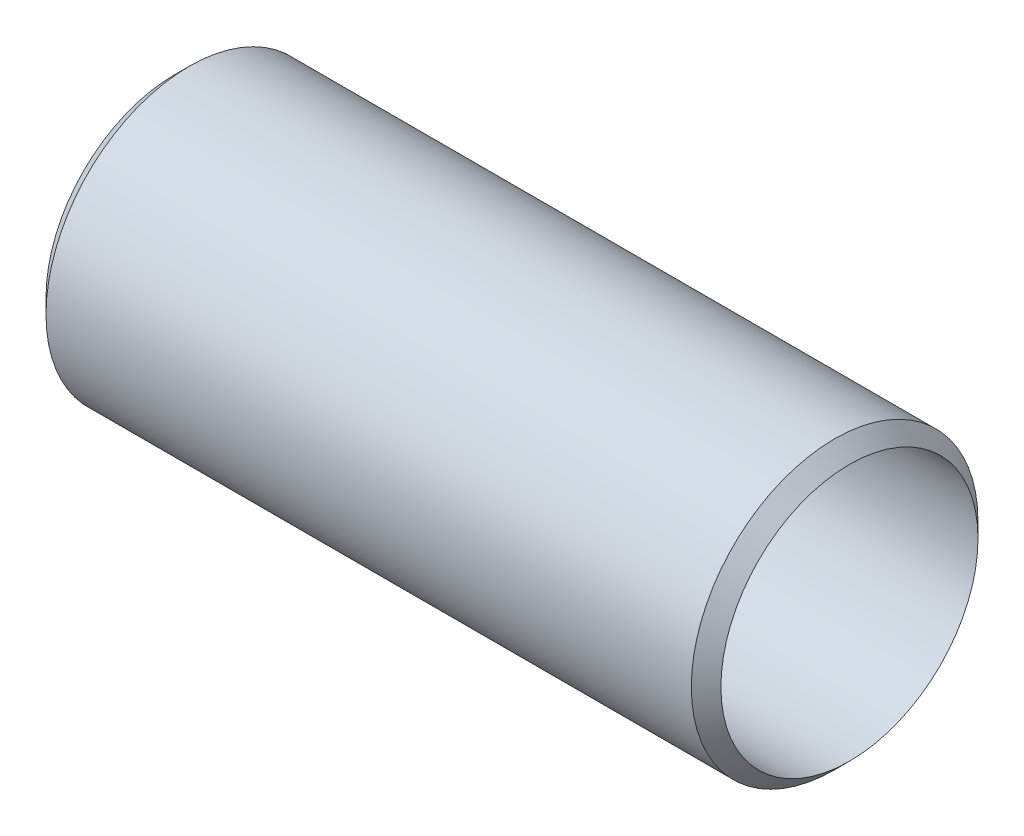
ISO-10303-21;
HEADER;
FILE_DESCRIPTION(('STEP AP214'),'2;1');
FILE_NAME('part.step','',(''),(''),'','','');
FILE_SCHEMA(('AUTOMOTIVE_DESIGN { 1 0 10303 214 1 1 1 1 }'));
ENDSEC;
DATA;
#1=APPLICATION_CONTEXT('core data for automotive mechanical design processes');
#2=APPLICATION_PROTOCOL_DEFINITION('international standard','automotive_design',2000,#1);
#3=PRODUCT_CONTEXT('',#1,'mechanical');
#4=PRODUCT('Part','Part','',(#3));
#5=PRODUCT_RELATED_PRODUCT_CATEGORY('part','',(#4));
#6=PRODUCT_DEFINITION_FORMATION('','',#4);
#7=PRODUCT_DEFINITION_CONTEXT('part definition',#1,'design');
#8=PRODUCT_DEFINITION('design','',#6,#7);
#9=PRODUCT_DEFINITION_SHAPE('','',#8);
#10=(LENGTH_UNIT() NAMED_UNIT(*) SI_UNIT(.MILLI.,.METRE.));
#11=(NAMED_UNIT(*) PLANE_ANGLE_UNIT() SI_UNIT($,.RADIAN.));
#12=(NAMED_UNIT(*) SI_UNIT($,.STERADIAN.) SOLID_ANGLE_UNIT());
#13=UNCERTAINTY_MEASURE_WITH_UNIT(LENGTH_MEASURE(1.E-05),#10,'distance_accuracy_value','');
#14=(GEOMETRIC_REPRESENTATION_CONTEXT(3) GLOBAL_UNCERTAINTY_ASSIGNED_CONTEXT((#13)) GLOBAL_UNIT_ASSIGNED_CONTEXT((#10,
#11,#12)) REPRESENTATION_CONTEXT('',''));
#15=CARTESIAN_POINT('',(0.,0.,0.));
#16=DIRECTION('',(0.,0.,1.));
#17=DIRECTION('',(1.,0.,0.));
#18=AXIS2_PLACEMENT_3D('',#15,#16,#17);
#19=CARTESIAN_POINT('',(-66.675,0.,0.));
#20=DIRECTION('',(1.,0.,0.));
#21=DIRECTION('',(0.,0.,-1.));
#22=AXIS2_PLACEMENT_3D('',#19,#20,#21);
#23=CYLINDRICAL_SURFACE('',#22,28.321);
#24=CARTESIAN_POINT('',(-63.754,0.,0.));
#25=DIRECTION('',(1.,0.,0.));
#26=DIRECTION('',(0.,0.,-1.));
#27=AXIS2_PLACEMENT_3D('',#24,#25,#26);
#28=CIRCLE('',#27,28.321);
#29=CARTESIAN_POINT('',(-63.754,0.,-28.321));
#30=VERTEX_POINT('',#29);
#31=EDGE_CURVE('E10',#30,#30,#28,.T.);
#32=ORIENTED_EDGE('',*,*,#31,.T.);
#33=EDGE_LOOP('',(#32));
#34=FACE_BOUND('',#33,.T.);
#35=CARTESIAN_POINT('',(63.754,0.,0.));
#36=DIRECTION('',(1.,0.,0.));
#37=DIRECTION('',(0.,0.,-1.));
#38=AXIS2_PLACEMENT_3D('',#35,#36,#37);
#39=CIRCLE('',#38,28.321);
#40=CARTESIAN_POINT('',(63.754,0.,-28.321));
#41=VERTEX_POINT('',#40);
#42=EDGE_CURVE('E54',#41,#41,#39,.F.);
#43=ORIENTED_EDGE('',*,*,#42,.T.);
#44=EDGE_LOOP('',(#43));
#45=FACE_BOUND('',#44,.T.);
#46=ADVANCED_FACE('F45',(#34,#45),#23,.T.);
#47=CARTESIAN_POINT('',(66.675,0.,0.));
#48=DIRECTION('',(1.,0.,0.));
#49=DIRECTION('',(0.,0.,-1.));
#50=AXIS2_PLACEMENT_3D('',#47,#48,#49);
#51=CYLINDRICAL_SURFACE('',#50,25.4);
#52=CARTESIAN_POINT('',(-66.675,0.,0.));
#53=DIRECTION('',(1.,0.,0.));
#54=DIRECTION('',(0.,0.,-1.));
#55=AXIS2_PLACEMENT_3D('',#52,#53,#54);
#56=CIRCLE('',#55,25.4);
#57=CARTESIAN_POINT('',(-66.675,0.,-25.4));
#58=VERTEX_POINT('',#57);
#59=EDGE_CURVE('E59',#58,#58,#56,.T.);
#60=ORIENTED_EDGE('',*,*,#59,.F.);
#61=EDGE_LOOP('',(#60));
#62=FACE_BOUND('',#61,.T.);
#63=CARTESIAN_POINT('',(66.675,0.,0.));
#64=DIRECTION('',(1.,0.,0.));
#65=DIRECTION('',(0.,0.,-1.));
#66=AXIS2_PLACEMENT_3D('',#63,#64,#65);
#67=CIRCLE('',#66,25.4);
#68=CARTESIAN_POINT('',(66.675,0.,-25.4));
#69=VERTEX_POINT('',#68);
#70=EDGE_CURVE('E64',#69,#69,#67,.T.);
#71=ORIENTED_EDGE('',*,*,#70,.T.);
#72=EDGE_LOOP('',(#71));
#73=FACE_BOUND('',#72,.T.);
#74=ADVANCED_FACE('F71',(#62,#73),#51,.F.);
#75=CARTESIAN_POINT('',(-63.754,0.,0.));
#76=DIRECTION('',(1.,0.,0.));
#77=DIRECTION('',(0.,0.,-1.));
#78=AXIS2_PLACEMENT_3D('',#75,#76,#77);
#79=CONICAL_SURFACE('',#78,28.321,0.785398163397454);
#80=ORIENTED_EDGE('',*,*,#59,.T.);
#81=EDGE_LOOP('',(#80));
#82=FACE_BOUND('',#81,.T.);
#83=ORIENTED_EDGE('',*,*,#31,.F.);
#84=EDGE_LOOP('',(#83));
#85=FACE_BOUND('',#84,.T.);
#86=ADVANCED_FACE('F74',(#82,#85),#79,.T.);
#87=CARTESIAN_POINT('',(66.675,0.,0.));
#88=DIRECTION('',(-1.,0.,0.));
#89=DIRECTION('',(0.,0.,1.));
#90=AXIS2_PLACEMENT_3D('',#87,#88,#89);
#91=CONICAL_SURFACE('',#90,25.4,0.785398163397439);
#92=ORIENTED_EDGE('',*,*,#42,.F.);
#93=EDGE_LOOP('',(#92));
#94=FACE_BOUND('',#93,.T.);
#95=ORIENTED_EDGE('',*,*,#70,.F.);
#96=EDGE_LOOP('',(#95));
#97=FACE_BOUND('',#96,.T.);
#98=ADVANCED_FACE('F48',(#94,#97),#91,.T.);
#99=CLOSED_SHELL('',(#46,#74,#86,#98));
#100=MANIFOLD_SOLID_BREP('B2',#99);
#101=ADVANCED_BREP_SHAPE_REPRESENTATION('',(#18,#100),#14);
#102=SHAPE_DEFINITION_REPRESENTATION(#9,#101);
ENDSEC;
END-ISO-10303-21;
